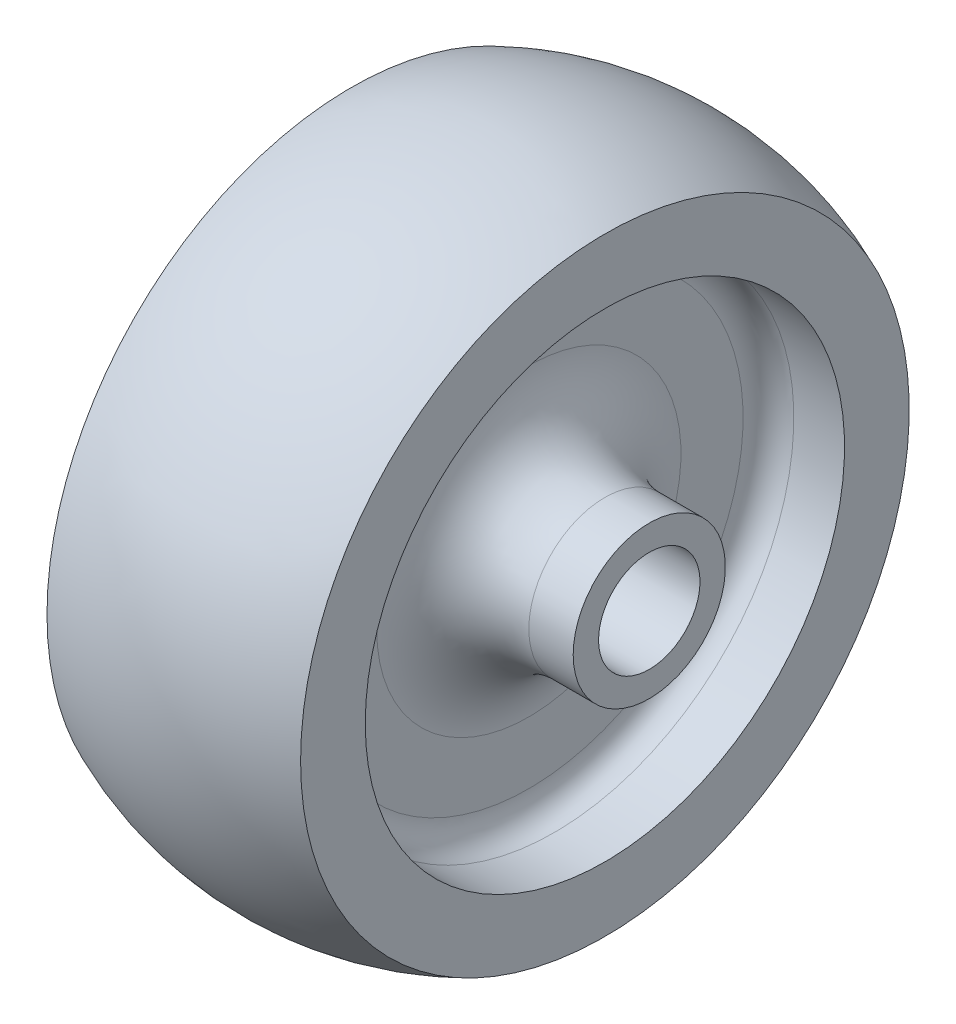
ISO-10303-21;
HEADER;
FILE_DESCRIPTION(('STEP AP214'),'2;1');
FILE_NAME('part.step','',(''),(''),'','','');
FILE_SCHEMA(('AUTOMOTIVE_DESIGN { 1 0 10303 214 1 1 1 1 }'));
ENDSEC;
DATA;
#1=APPLICATION_CONTEXT('core data for automotive mechanical design processes');
#2=APPLICATION_PROTOCOL_DEFINITION('international standard','automotive_design',2000,#1);
#3=PRODUCT_CONTEXT('',#1,'mechanical');
#4=PRODUCT('Part','Part','',(#3));
#5=PRODUCT_RELATED_PRODUCT_CATEGORY('part','',(#4));
#6=PRODUCT_DEFINITION_FORMATION('','',#4);
#7=PRODUCT_DEFINITION_CONTEXT('part definition',#1,'design');
#8=PRODUCT_DEFINITION('design','',#6,#7);
#9=PRODUCT_DEFINITION_SHAPE('','',#8);
#10=(LENGTH_UNIT() NAMED_UNIT(*) SI_UNIT(.MILLI.,.METRE.));
#11=(NAMED_UNIT(*) PLANE_ANGLE_UNIT() SI_UNIT($,.RADIAN.));
#12=(NAMED_UNIT(*) SI_UNIT($,.STERADIAN.) SOLID_ANGLE_UNIT());
#13=UNCERTAINTY_MEASURE_WITH_UNIT(LENGTH_MEASURE(1.E-05),#10,'distance_accuracy_value','');
#14=(GEOMETRIC_REPRESENTATION_CONTEXT(3) GLOBAL_UNCERTAINTY_ASSIGNED_CONTEXT((#13)) GLOBAL_UNIT_ASSIGNED_CONTEXT((#10,
#11,#12)) REPRESENTATION_CONTEXT('',''));
#15=CARTESIAN_POINT('',(0.,0.,0.));
#16=DIRECTION('',(0.,0.,1.));
#17=DIRECTION('',(1.,0.,0.));
#18=AXIS2_PLACEMENT_3D('',#15,#16,#17);
#19=CARTESIAN_POINT('',(6.75,0.,0.));
#20=DIRECTION('',(-1.,0.,0.));
#21=DIRECTION('',(0.,0.,1.));
#22=AXIS2_PLACEMENT_3D('',#19,#20,#21);
#23=DEGENERATE_TOROIDAL_SURFACE('',#22,0.543560762610399,12.5,.T.);
#24=CARTESIAN_POINT('',(1.75,0.,0.));
#25=DIRECTION('',(-1.,0.,0.));
#26=DIRECTION('',(0.,0.,1.));
#27=AXIS2_PLACEMENT_3D('',#24,#25,#26);
#28=CIRCLE('',#27,12.);
#29=CARTESIAN_POINT('',(1.75,0.,12.));
#30=VERTEX_POINT('',#29);
#31=EDGE_CURVE('E86',#30,#30,#28,.T.);
#32=ORIENTED_EDGE('',*,*,#31,.F.);
#33=EDGE_LOOP('',(#32));
#34=FACE_BOUND('',#33,.T.);
#35=CARTESIAN_POINT('',(11.75,0.,0.));
#36=DIRECTION('',(-1.,0.,0.));
#37=DIRECTION('',(0.,0.,1.));
#38=AXIS2_PLACEMENT_3D('',#35,#36,#37);
#39=CIRCLE('',#38,12.);
#40=CARTESIAN_POINT('',(11.75,0.,12.));
#41=VERTEX_POINT('',#40);
#42=EDGE_CURVE('E53',#41,#41,#39,.T.);
#43=ORIENTED_EDGE('',*,*,#42,.T.);
#44=EDGE_LOOP('',(#43));
#45=FACE_BOUND('',#44,.T.);
#46=ADVANCED_FACE('F33',(#34,#45),#23,.T.);
#47=CARTESIAN_POINT('',(11.75,12.,0.));
#48=DIRECTION('',(-1.,0.,0.));
#49=DIRECTION('',(0.,0.,1.));
#50=AXIS2_PLACEMENT_3D('',#47,#48,#49);
#51=PLANE('',#50);
#52=ORIENTED_EDGE('',*,*,#42,.F.);
#53=EDGE_LOOP('',(#52));
#54=FACE_BOUND('',#53,.T.);
#55=CARTESIAN_POINT('',(11.75,0.,0.));
#56=DIRECTION('',(-1.,0.,0.));
#57=DIRECTION('',(0.,0.,1.));
#58=AXIS2_PLACEMENT_3D('',#55,#56,#57);
#59=CIRCLE('',#58,9.45);
#60=CARTESIAN_POINT('',(11.75,0.,9.45));
#61=VERTEX_POINT('',#60);
#62=EDGE_CURVE('E56',#61,#61,#59,.T.);
#63=ORIENTED_EDGE('',*,*,#62,.T.);
#64=EDGE_LOOP('',(#63));
#65=FACE_BOUND('',#64,.T.);
#66=ADVANCED_FACE('F94',(#54,#65),#51,.F.);
#67=CARTESIAN_POINT('',(0.,0.,0.));
#68=DIRECTION('',(-1.,0.,0.));
#69=DIRECTION('',(0.,0.,1.));
#70=AXIS2_PLACEMENT_3D('',#67,#68,#69);
#71=CYLINDRICAL_SURFACE('',#70,9.45);
#72=ORIENTED_EDGE('',*,*,#62,.F.);
#73=EDGE_LOOP('',(#72));
#74=FACE_BOUND('',#73,.T.);
#75=CARTESIAN_POINT('',(9.75000000000001,0.,0.));
#76=DIRECTION('',(-1.,0.,0.));
#77=DIRECTION('',(0.,0.,1.));
#78=AXIS2_PLACEMENT_3D('',#75,#76,#77);
#79=CIRCLE('',#78,9.45);
#80=CARTESIAN_POINT('',(9.75000000000001,0.,9.45));
#81=VERTEX_POINT('',#80);
#82=EDGE_CURVE('E59',#81,#81,#79,.T.);
#83=ORIENTED_EDGE('',*,*,#82,.T.);
#84=EDGE_LOOP('',(#83));
#85=FACE_BOUND('',#84,.T.);
#86=ADVANCED_FACE('F100',(#74,#85),#71,.F.);
#87=CARTESIAN_POINT('',(9.75,0.,0.));
#88=DIRECTION('',(-1.,0.,0.));
#89=DIRECTION('',(0.,0.,1.));
#90=AXIS2_PLACEMENT_3D('',#87,#88,#89);
#91=TOROIDAL_SURFACE('',#90,8.45,0.999999999999999);
#92=ORIENTED_EDGE('',*,*,#82,.F.);
#93=EDGE_LOOP('',(#92));
#94=FACE_BOUND('',#93,.T.);
#95=CARTESIAN_POINT('',(8.75,0.,0.));
#96=DIRECTION('',(-1.,0.,0.));
#97=DIRECTION('',(0.,0.,1.));
#98=AXIS2_PLACEMENT_3D('',#95,#96,#97);
#99=CIRCLE('',#98,8.44999999999999);
#100=CARTESIAN_POINT('',(8.75,0.,8.44999999999999));
#101=VERTEX_POINT('',#100);
#102=EDGE_CURVE('E62',#101,#101,#99,.T.);
#103=ORIENTED_EDGE('',*,*,#102,.T.);
#104=EDGE_LOOP('',(#103));
#105=FACE_BOUND('',#104,.T.);
#106=ADVANCED_FACE('F106',(#94,#105),#91,.F.);
#107=CARTESIAN_POINT('',(8.75,3.,0.));
#108=DIRECTION('',(-1.,0.,0.));
#109=DIRECTION('',(0.,0.,1.));
#110=AXIS2_PLACEMENT_3D('',#107,#108,#109);
#111=PLANE('',#110);
#112=CARTESIAN_POINT('',(8.75,0.,0.));
#113=DIRECTION('',(-1.,0.,0.));
#114=DIRECTION('',(0.,0.,1.));
#115=AXIS2_PLACEMENT_3D('',#112,#113,#114);
#116=CIRCLE('',#115,6.);
#117=CARTESIAN_POINT('',(8.75,0.,6.));
#118=VERTEX_POINT('',#117);
#119=EDGE_CURVE('E48',#118,#118,#116,.T.);
#120=ORIENTED_EDGE('',*,*,#119,.T.);
#121=EDGE_LOOP('',(#120));
#122=FACE_BOUND('',#121,.T.);
#123=ORIENTED_EDGE('',*,*,#102,.F.);
#124=EDGE_LOOP('',(#123));
#125=FACE_BOUND('',#124,.T.);
#126=ADVANCED_FACE('F112',(#122,#125),#111,.F.);
#127=CARTESIAN_POINT('',(0.,0.,0.));
#128=DIRECTION('',(-1.,0.,0.));
#129=DIRECTION('',(0.,0.,1.));
#130=AXIS2_PLACEMENT_3D('',#127,#128,#129);
#131=CYLINDRICAL_SURFACE('',#130,3.);
#132=CARTESIAN_POINT('',(11.75,0.,0.));
#133=DIRECTION('',(-1.,0.,0.));
#134=DIRECTION('',(0.,0.,1.));
#135=AXIS2_PLACEMENT_3D('',#132,#133,#134);
#136=CIRCLE('',#135,3.);
#137=CARTESIAN_POINT('',(11.75,0.,3.));
#138=VERTEX_POINT('',#137);
#139=EDGE_CURVE('E44',#138,#138,#136,.F.);
#140=ORIENTED_EDGE('',*,*,#139,.T.);
#141=EDGE_LOOP('',(#140));
#142=FACE_BOUND('',#141,.T.);
#143=CARTESIAN_POINT('',(13.5,0.,0.));
#144=DIRECTION('',(-1.,0.,0.));
#145=DIRECTION('',(0.,0.,1.));
#146=AXIS2_PLACEMENT_3D('',#143,#144,#145);
#147=CIRCLE('',#146,3.);
#148=CARTESIAN_POINT('',(13.5,0.,3.));
#149=VERTEX_POINT('',#148);
#150=EDGE_CURVE('E65',#149,#149,#147,.T.);
#151=ORIENTED_EDGE('',*,*,#150,.T.);
#152=EDGE_LOOP('',(#151));
#153=FACE_BOUND('',#152,.T.);
#154=ADVANCED_FACE('F117',(#142,#153),#131,.T.);
#155=CARTESIAN_POINT('',(13.5,3.,0.));
#156=DIRECTION('',(-1.,0.,0.));
#157=DIRECTION('',(0.,0.,1.));
#158=AXIS2_PLACEMENT_3D('',#155,#156,#157);
#159=PLANE('',#158);
#160=ORIENTED_EDGE('',*,*,#150,.F.);
#161=EDGE_LOOP('',(#160));
#162=FACE_BOUND('',#161,.T.);
#163=CARTESIAN_POINT('',(13.5,0.,0.));
#164=DIRECTION('',(-1.,0.,0.));
#165=DIRECTION('',(0.,0.,1.));
#166=AXIS2_PLACEMENT_3D('',#163,#164,#165);
#167=CIRCLE('',#166,2.);
#168=CARTESIAN_POINT('',(13.5,0.,2.));
#169=VERTEX_POINT('',#168);
#170=EDGE_CURVE('E68',#169,#169,#167,.T.);
#171=ORIENTED_EDGE('',*,*,#170,.T.);
#172=EDGE_LOOP('',(#171));
#173=FACE_BOUND('',#172,.T.);
#174=ADVANCED_FACE('F123',(#162,#173),#159,.F.);
#175=CARTESIAN_POINT('',(0.,0.,0.));
#176=DIRECTION('',(-1.,0.,0.));
#177=DIRECTION('',(0.,0.,1.));
#178=AXIS2_PLACEMENT_3D('',#175,#176,#177);
#179=CYLINDRICAL_SURFACE('',#178,2.);
#180=ORIENTED_EDGE('',*,*,#170,.F.);
#181=EDGE_LOOP('',(#180));
#182=FACE_BOUND('',#181,.T.);
#183=CARTESIAN_POINT('',(0.,0.,0.));
#184=DIRECTION('',(-1.,0.,0.));
#185=DIRECTION('',(0.,0.,1.));
#186=AXIS2_PLACEMENT_3D('',#183,#184,#185);
#187=CIRCLE('',#186,2.);
#188=CARTESIAN_POINT('',(0.,0.,2.));
#189=VERTEX_POINT('',#188);
#190=EDGE_CURVE('E71',#189,#189,#187,.T.);
#191=ORIENTED_EDGE('',*,*,#190,.T.);
#192=EDGE_LOOP('',(#191));
#193=FACE_BOUND('',#192,.T.);
#194=ADVANCED_FACE('F146',(#182,#193),#179,.F.);
#195=CARTESIAN_POINT('',(0.,2.,0.));
#196=DIRECTION('',(1.,0.,0.));
#197=DIRECTION('',(0.,0.,-1.));
#198=AXIS2_PLACEMENT_3D('',#195,#196,#197);
#199=PLANE('',#198);
#200=ORIENTED_EDGE('',*,*,#190,.F.);
#201=EDGE_LOOP('',(#200));
#202=FACE_BOUND('',#201,.T.);
#203=CARTESIAN_POINT('',(0.,0.,0.));
#204=DIRECTION('',(-1.,0.,0.));
#205=DIRECTION('',(0.,0.,1.));
#206=AXIS2_PLACEMENT_3D('',#203,#204,#205);
#207=CIRCLE('',#206,3.);
#208=CARTESIAN_POINT('',(0.,0.,3.));
#209=VERTEX_POINT('',#208);
#210=EDGE_CURVE('E74',#209,#209,#207,.T.);
#211=ORIENTED_EDGE('',*,*,#210,.T.);
#212=EDGE_LOOP('',(#211));
#213=FACE_BOUND('',#212,.T.);
#214=ADVANCED_FACE('F151',(#202,#213),#199,.F.);
#215=CARTESIAN_POINT('',(0.,0.,0.));
#216=DIRECTION('',(-1.,0.,0.));
#217=DIRECTION('',(0.,0.,1.));
#218=AXIS2_PLACEMENT_3D('',#215,#216,#217);
#219=CYLINDRICAL_SURFACE('',#218,3.);
#220=CARTESIAN_POINT('',(1.75,0.,0.));
#221=DIRECTION('',(1.,0.,0.));
#222=DIRECTION('',(0.,0.,-1.));
#223=AXIS2_PLACEMENT_3D('',#220,#221,#222);
#224=CIRCLE('',#223,3.);
#225=CARTESIAN_POINT('',(1.75,0.,-3.));
#226=VERTEX_POINT('',#225);
#227=EDGE_CURVE('E40',#226,#226,#224,.F.);
#228=ORIENTED_EDGE('',*,*,#227,.T.);
#229=EDGE_LOOP('',(#228));
#230=FACE_BOUND('',#229,.T.);
#231=ORIENTED_EDGE('',*,*,#210,.F.);
#232=EDGE_LOOP('',(#231));
#233=FACE_BOUND('',#232,.T.);
#234=ADVANCED_FACE('F157',(#230,#233),#219,.T.);
#235=CARTESIAN_POINT('',(4.75,3.,0.));
#236=DIRECTION('',(1.,0.,0.));
#237=DIRECTION('',(0.,0.,-1.));
#238=AXIS2_PLACEMENT_3D('',#235,#236,#237);
#239=PLANE('',#238);
#240=CARTESIAN_POINT('',(4.75,0.,0.));
#241=DIRECTION('',(1.,0.,0.));
#242=DIRECTION('',(0.,0.,-1.));
#243=AXIS2_PLACEMENT_3D('',#240,#241,#242);
#244=CIRCLE('',#243,6.);
#245=CARTESIAN_POINT('',(4.75,0.,-6.));
#246=VERTEX_POINT('',#245);
#247=EDGE_CURVE('E10',#246,#246,#244,.T.);
#248=ORIENTED_EDGE('',*,*,#247,.T.);
#249=EDGE_LOOP('',(#248));
#250=FACE_BOUND('',#249,.T.);
#251=CARTESIAN_POINT('',(4.75,0.,0.));
#252=DIRECTION('',(-1.,0.,0.));
#253=DIRECTION('',(0.,0.,1.));
#254=AXIS2_PLACEMENT_3D('',#251,#252,#253);
#255=CIRCLE('',#254,8.45);
#256=CARTESIAN_POINT('',(4.75,0.,8.45));
#257=VERTEX_POINT('',#256);
#258=EDGE_CURVE('E77',#257,#257,#255,.T.);
#259=ORIENTED_EDGE('',*,*,#258,.T.);
#260=EDGE_LOOP('',(#259));
#261=FACE_BOUND('',#260,.T.);
#262=ADVANCED_FACE('F162',(#250,#261),#239,.F.);
#263=CARTESIAN_POINT('',(3.75,0.,0.));
#264=DIRECTION('',(-1.,0.,0.));
#265=DIRECTION('',(0.,0.,1.));
#266=AXIS2_PLACEMENT_3D('',#263,#264,#265);
#267=TOROIDAL_SURFACE('',#266,8.45,1.);
#268=ORIENTED_EDGE('',*,*,#258,.F.);
#269=EDGE_LOOP('',(#268));
#270=FACE_BOUND('',#269,.T.);
#271=CARTESIAN_POINT('',(3.75,0.,0.));
#272=DIRECTION('',(-1.,0.,0.));
#273=DIRECTION('',(0.,0.,1.));
#274=AXIS2_PLACEMENT_3D('',#271,#272,#273);
#275=CIRCLE('',#274,9.45);
#276=CARTESIAN_POINT('',(3.75,0.,9.45));
#277=VERTEX_POINT('',#276);
#278=EDGE_CURVE('E80',#277,#277,#275,.T.);
#279=ORIENTED_EDGE('',*,*,#278,.T.);
#280=EDGE_LOOP('',(#279));
#281=FACE_BOUND('',#280,.T.);
#282=ADVANCED_FACE('F167',(#270,#281),#267,.F.);
#283=CARTESIAN_POINT('',(0.,0.,0.));
#284=DIRECTION('',(-1.,0.,0.));
#285=DIRECTION('',(0.,0.,1.));
#286=AXIS2_PLACEMENT_3D('',#283,#284,#285);
#287=CYLINDRICAL_SURFACE('',#286,9.45);
#288=ORIENTED_EDGE('',*,*,#278,.F.);
#289=EDGE_LOOP('',(#288));
#290=FACE_BOUND('',#289,.T.);
#291=CARTESIAN_POINT('',(1.75,0.,0.));
#292=DIRECTION('',(-1.,0.,0.));
#293=DIRECTION('',(0.,0.,1.));
#294=AXIS2_PLACEMENT_3D('',#291,#292,#293);
#295=CIRCLE('',#294,9.45);
#296=CARTESIAN_POINT('',(1.75,0.,9.45));
#297=VERTEX_POINT('',#296);
#298=EDGE_CURVE('E83',#297,#297,#295,.T.);
#299=ORIENTED_EDGE('',*,*,#298,.T.);
#300=EDGE_LOOP('',(#299));
#301=FACE_BOUND('',#300,.T.);
#302=ADVANCED_FACE('F135',(#290,#301),#287,.F.);
#303=CARTESIAN_POINT('',(1.75,9.45,0.));
#304=DIRECTION('',(1.,0.,0.));
#305=DIRECTION('',(0.,0.,-1.));
#306=AXIS2_PLACEMENT_3D('',#303,#304,#305);
#307=PLANE('',#306);
#308=ORIENTED_EDGE('',*,*,#298,.F.);
#309=EDGE_LOOP('',(#308));
#310=FACE_BOUND('',#309,.T.);
#311=ORIENTED_EDGE('',*,*,#31,.T.);
#312=EDGE_LOOP('',(#311));
#313=FACE_BOUND('',#312,.T.);
#314=ADVANCED_FACE('F90',(#310,#313),#307,.F.);
#315=CARTESIAN_POINT('',(11.75,0.,0.));
#316=DIRECTION('',(-1.,0.,0.));
#317=DIRECTION('',(0.,0.,1.));
#318=AXIS2_PLACEMENT_3D('',#315,#316,#317);
#319=TOROIDAL_SURFACE('',#318,6.,3.);
#320=ORIENTED_EDGE('',*,*,#139,.F.);
#321=EDGE_LOOP('',(#320));
#322=FACE_BOUND('',#321,.T.);
#323=ORIENTED_EDGE('',*,*,#119,.F.);
#324=EDGE_LOOP('',(#323));
#325=FACE_BOUND('',#324,.T.);
#326=ADVANCED_FACE('F127',(#322,#325),#319,.F.);
#327=CARTESIAN_POINT('',(1.75,0.,0.));
#328=DIRECTION('',(1.,0.,0.));
#329=DIRECTION('',(0.,0.,-1.));
#330=AXIS2_PLACEMENT_3D('',#327,#328,#329);
#331=TOROIDAL_SURFACE('',#330,6.,3.);
#332=ORIENTED_EDGE('',*,*,#247,.F.);
#333=EDGE_LOOP('',(#332));
#334=FACE_BOUND('',#333,.T.);
#335=ORIENTED_EDGE('',*,*,#227,.F.);
#336=EDGE_LOOP('',(#335));
#337=FACE_BOUND('',#336,.T.);
#338=ADVANCED_FACE('F35',(#334,#337),#331,.F.);
#339=CLOSED_SHELL('',(#46,#66,#86,#106,#126,#154,#174,#194,#214,#234,#262,#282,#302,#314,#326,#338));
#340=MANIFOLD_SOLID_BREP('B2',#339);
#341=ADVANCED_BREP_SHAPE_REPRESENTATION('',(#18,#340),#14);
#342=SHAPE_DEFINITION_REPRESENTATION(#9,#341);
ENDSEC;
END-ISO-10303-21;
